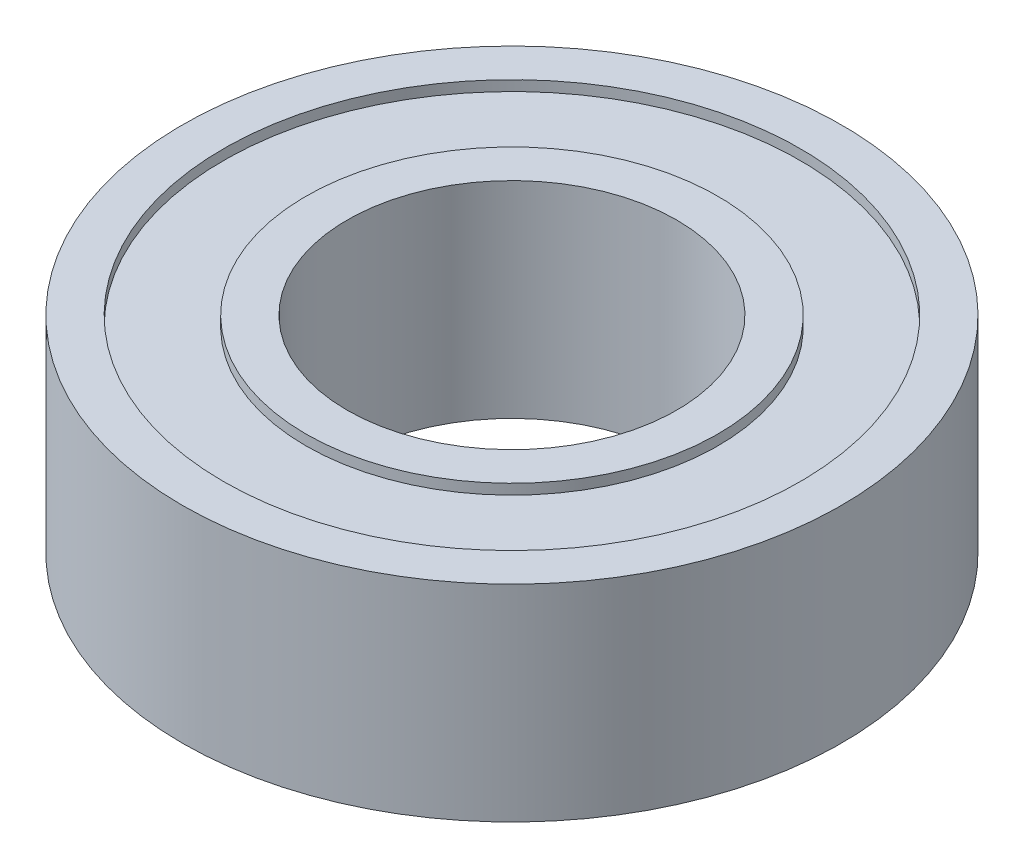
ISO-10303-21;
HEADER;
FILE_DESCRIPTION(('STEP AP214'),'2;1');
FILE_NAME('part.step','',(''),(''),'','','');
FILE_SCHEMA(('AUTOMOTIVE_DESIGN { 1 0 10303 214 1 1 1 1 }'));
ENDSEC;
DATA;
#1=APPLICATION_CONTEXT('core data for automotive mechanical design processes');
#2=APPLICATION_PROTOCOL_DEFINITION('international standard','automotive_design',2000,#1);
#3=PRODUCT_CONTEXT('',#1,'mechanical');
#4=PRODUCT('Part','Part','',(#3));
#5=PRODUCT_RELATED_PRODUCT_CATEGORY('part','',(#4));
#6=PRODUCT_DEFINITION_FORMATION('','',#4);
#7=PRODUCT_DEFINITION_CONTEXT('part definition',#1,'design');
#8=PRODUCT_DEFINITION('design','',#6,#7);
#9=PRODUCT_DEFINITION_SHAPE('','',#8);
#10=(LENGTH_UNIT() NAMED_UNIT(*) SI_UNIT(.MILLI.,.METRE.));
#11=(NAMED_UNIT(*) PLANE_ANGLE_UNIT() SI_UNIT($,.RADIAN.));
#12=(NAMED_UNIT(*) SI_UNIT($,.STERADIAN.) SOLID_ANGLE_UNIT());
#13=UNCERTAINTY_MEASURE_WITH_UNIT(LENGTH_MEASURE(1.E-05),#10,'distance_accuracy_value','');
#14=(GEOMETRIC_REPRESENTATION_CONTEXT(3) GLOBAL_UNCERTAINTY_ASSIGNED_CONTEXT((#13)) GLOBAL_UNIT_ASSIGNED_CONTEXT((#10,
#11,#12)) REPRESENTATION_CONTEXT('',''));
#15=CARTESIAN_POINT('',(0.,0.,0.));
#16=DIRECTION('',(0.,0.,1.));
#17=DIRECTION('',(1.,0.,0.));
#18=AXIS2_PLACEMENT_3D('',#15,#16,#17);
#19=CARTESIAN_POINT('',(0.,-2.25,0.));
#20=DIRECTION('',(0.,1.,0.));
#21=DIRECTION('',(0.,0.,1.));
#22=AXIS2_PLACEMENT_3D('',#19,#20,#21);
#23=CYLINDRICAL_SURFACE('',#22,7.);
#24=CARTESIAN_POINT('',(0.,-2.25,0.));
#25=DIRECTION('',(0.,1.,0.));
#26=DIRECTION('',(0.,0.,1.));
#27=AXIS2_PLACEMENT_3D('',#24,#25,#26);
#28=CIRCLE('',#27,7.);
#29=CARTESIAN_POINT('',(0.,-2.25,7.));
#30=VERTEX_POINT('',#29);
#31=EDGE_CURVE('E12',#30,#30,#28,.T.);
#32=ORIENTED_EDGE('',*,*,#31,.T.);
#33=EDGE_LOOP('',(#32));
#34=FACE_BOUND('',#33,.T.);
#35=CARTESIAN_POINT('',(0.,2.25,0.));
#36=DIRECTION('',(0.,1.,0.));
#37=DIRECTION('',(0.,0.,1.));
#38=AXIS2_PLACEMENT_3D('',#35,#36,#37);
#39=CIRCLE('',#38,7.);
#40=CARTESIAN_POINT('',(0.,2.25,7.));
#41=VERTEX_POINT('',#40);
#42=EDGE_CURVE('E61',#41,#41,#39,.T.);
#43=ORIENTED_EDGE('',*,*,#42,.F.);
#44=EDGE_LOOP('',(#43));
#45=FACE_BOUND('',#44,.T.);
#46=ADVANCED_FACE('F51',(#34,#45),#23,.T.);
#47=CARTESIAN_POINT('',(0.,-2.25,0.));
#48=DIRECTION('',(0.,1.,0.));
#49=DIRECTION('',(0.,0.,1.));
#50=AXIS2_PLACEMENT_3D('',#47,#48,#49);
#51=PLANE('',#50);
#52=CARTESIAN_POINT('',(0.,-2.25,0.));
#53=DIRECTION('',(0.,1.,0.));
#54=DIRECTION('',(0.,0.,1.));
#55=AXIS2_PLACEMENT_3D('',#52,#53,#54);
#56=CIRCLE('',#55,5.);
#57=CARTESIAN_POINT('',(0.,-2.25,5.));
#58=VERTEX_POINT('',#57);
#59=EDGE_CURVE('E57',#58,#58,#56,.T.);
#60=ORIENTED_EDGE('',*,*,#59,.T.);
#61=EDGE_LOOP('',(#60));
#62=FACE_BOUND('',#61,.T.);
#63=ORIENTED_EDGE('',*,*,#31,.F.);
#64=EDGE_LOOP('',(#63));
#65=FACE_BOUND('',#64,.T.);
#66=ADVANCED_FACE('F80',(#62,#65),#51,.F.);
#67=CARTESIAN_POINT('',(0.,-2.25,0.));
#68=DIRECTION('',(0.,1.,0.));
#69=DIRECTION('',(0.,0.,1.));
#70=AXIS2_PLACEMENT_3D('',#67,#68,#69);
#71=CYLINDRICAL_SURFACE('',#70,5.);
#72=ORIENTED_EDGE('',*,*,#59,.F.);
#73=EDGE_LOOP('',(#72));
#74=FACE_BOUND('',#73,.T.);
#75=CARTESIAN_POINT('',(0.,2.25,0.));
#76=DIRECTION('',(0.,1.,0.));
#77=DIRECTION('',(0.,0.,1.));
#78=AXIS2_PLACEMENT_3D('',#75,#76,#77);
#79=CIRCLE('',#78,5.);
#80=CARTESIAN_POINT('',(0.,2.25,5.));
#81=VERTEX_POINT('',#80);
#82=EDGE_CURVE('E65',#81,#81,#79,.T.);
#83=ORIENTED_EDGE('',*,*,#82,.T.);
#84=EDGE_LOOP('',(#83));
#85=FACE_BOUND('',#84,.T.);
#86=ADVANCED_FACE('F71',(#74,#85),#71,.F.);
#87=CARTESIAN_POINT('',(0.,2.25,0.));
#88=DIRECTION('',(0.,1.,0.));
#89=DIRECTION('',(0.,0.,1.));
#90=AXIS2_PLACEMENT_3D('',#87,#88,#89);
#91=PLANE('',#90);
#92=ORIENTED_EDGE('',*,*,#42,.T.);
#93=EDGE_LOOP('',(#92));
#94=FACE_BOUND('',#93,.T.);
#95=ORIENTED_EDGE('',*,*,#82,.F.);
#96=EDGE_LOOP('',(#95));
#97=FACE_BOUND('',#96,.T.);
#98=ADVANCED_FACE('F73',(#94,#97),#91,.T.);
#99=CLOSED_SHELL('',(#46,#66,#86,#98));
#100=MANIFOLD_SOLID_BREP('B2',#99);
#101=CARTESIAN_POINT('',(0.,-2.5,0.));
#102=DIRECTION('',(0.,1.,0.));
#103=DIRECTION('',(0.,0.,1.));
#104=AXIS2_PLACEMENT_3D('',#101,#102,#103);
#105=CYLINDRICAL_SURFACE('',#104,4.);
#106=CARTESIAN_POINT('',(0.,-2.5,0.));
#107=DIRECTION('',(0.,1.,0.));
#108=DIRECTION('',(0.,0.,1.));
#109=AXIS2_PLACEMENT_3D('',#106,#107,#108);
#110=CIRCLE('',#109,4.);
#111=CARTESIAN_POINT('',(0.,-2.5,4.));
#112=VERTEX_POINT('',#111);
#113=EDGE_CURVE('E125',#112,#112,#110,.T.);
#114=ORIENTED_EDGE('',*,*,#113,.F.);
#115=EDGE_LOOP('',(#114));
#116=FACE_BOUND('',#115,.T.);
#117=CARTESIAN_POINT('',(0.,2.5,0.));
#118=DIRECTION('',(0.,1.,0.));
#119=DIRECTION('',(0.,0.,1.));
#120=AXIS2_PLACEMENT_3D('',#117,#118,#119);
#121=CIRCLE('',#120,4.);
#122=CARTESIAN_POINT('',(0.,2.5,4.));
#123=VERTEX_POINT('',#122);
#124=EDGE_CURVE('E133',#123,#123,#121,.T.);
#125=ORIENTED_EDGE('',*,*,#124,.T.);
#126=EDGE_LOOP('',(#125));
#127=FACE_BOUND('',#126,.T.);
#128=ADVANCED_FACE('F119',(#116,#127),#105,.F.);
#129=CARTESIAN_POINT('',(0.,-2.5,0.));
#130=DIRECTION('',(0.,1.,0.));
#131=DIRECTION('',(0.,0.,1.));
#132=AXIS2_PLACEMENT_3D('',#129,#130,#131);
#133=CYLINDRICAL_SURFACE('',#132,5.);
#134=CARTESIAN_POINT('',(0.,-2.5,0.));
#135=DIRECTION('',(0.,1.,0.));
#136=DIRECTION('',(0.,0.,1.));
#137=AXIS2_PLACEMENT_3D('',#134,#135,#136);
#138=CIRCLE('',#137,5.);
#139=CARTESIAN_POINT('',(0.,-2.5,5.));
#140=VERTEX_POINT('',#139);
#141=EDGE_CURVE('E50',#140,#140,#138,.T.);
#142=ORIENTED_EDGE('',*,*,#141,.T.);
#143=EDGE_LOOP('',(#142));
#144=FACE_BOUND('',#143,.T.);
#145=CARTESIAN_POINT('',(0.,2.5,0.));
#146=DIRECTION('',(0.,1.,0.));
#147=DIRECTION('',(0.,0.,1.));
#148=AXIS2_PLACEMENT_3D('',#145,#146,#147);
#149=CIRCLE('',#148,5.);
#150=CARTESIAN_POINT('',(0.,2.5,5.));
#151=VERTEX_POINT('',#150);
#152=EDGE_CURVE('E129',#151,#151,#149,.T.);
#153=ORIENTED_EDGE('',*,*,#152,.F.);
#154=EDGE_LOOP('',(#153));
#155=FACE_BOUND('',#154,.T.);
#156=ADVANCED_FACE('F147',(#144,#155),#133,.T.);
#157=CARTESIAN_POINT('',(0.,-2.5,0.));
#158=DIRECTION('',(0.,1.,0.));
#159=DIRECTION('',(0.,0.,1.));
#160=AXIS2_PLACEMENT_3D('',#157,#158,#159);
#161=PLANE('',#160);
#162=ORIENTED_EDGE('',*,*,#113,.T.);
#163=EDGE_LOOP('',(#162));
#164=FACE_BOUND('',#163,.T.);
#165=ORIENTED_EDGE('',*,*,#141,.F.);
#166=EDGE_LOOP('',(#165));
#167=FACE_BOUND('',#166,.T.);
#168=ADVANCED_FACE('F143',(#164,#167),#161,.F.);
#169=CARTESIAN_POINT('',(0.,2.5,0.));
#170=DIRECTION('',(0.,1.,0.));
#171=DIRECTION('',(0.,0.,1.));
#172=AXIS2_PLACEMENT_3D('',#169,#170,#171);
#173=PLANE('',#172);
#174=ORIENTED_EDGE('',*,*,#124,.F.);
#175=EDGE_LOOP('',(#174));
#176=FACE_BOUND('',#175,.T.);
#177=ORIENTED_EDGE('',*,*,#152,.T.);
#178=EDGE_LOOP('',(#177));
#179=FACE_BOUND('',#178,.T.);
#180=ADVANCED_FACE('F140',(#176,#179),#173,.T.);
#181=CLOSED_SHELL('',(#128,#156,#168,#180));
#182=MANIFOLD_SOLID_BREP('B7',#181);
#183=CARTESIAN_POINT('',(0.,-2.5,0.));
#184=DIRECTION('',(0.,1.,0.));
#185=DIRECTION('',(0.,0.,1.));
#186=AXIS2_PLACEMENT_3D('',#183,#184,#185);
#187=CYLINDRICAL_SURFACE('',#186,7.);
#188=CARTESIAN_POINT('',(0.,-2.5,0.));
#189=DIRECTION('',(0.,1.,0.));
#190=DIRECTION('',(0.,0.,1.));
#191=AXIS2_PLACEMENT_3D('',#188,#189,#190);
#192=CIRCLE('',#191,7.);
#193=CARTESIAN_POINT('',(0.,-2.5,7.));
#194=VERTEX_POINT('',#193);
#195=EDGE_CURVE('E186',#194,#194,#192,.T.);
#196=ORIENTED_EDGE('',*,*,#195,.F.);
#197=EDGE_LOOP('',(#196));
#198=FACE_BOUND('',#197,.T.);
#199=CARTESIAN_POINT('',(0.,2.5,0.));
#200=DIRECTION('',(0.,1.,0.));
#201=DIRECTION('',(0.,0.,1.));
#202=AXIS2_PLACEMENT_3D('',#199,#200,#201);
#203=CIRCLE('',#202,7.);
#204=CARTESIAN_POINT('',(0.,2.5,7.));
#205=VERTEX_POINT('',#204);
#206=EDGE_CURVE('E194',#205,#205,#203,.T.);
#207=ORIENTED_EDGE('',*,*,#206,.T.);
#208=EDGE_LOOP('',(#207));
#209=FACE_BOUND('',#208,.T.);
#210=ADVANCED_FACE('F180',(#198,#209),#187,.F.);
#211=CARTESIAN_POINT('',(0.,-2.5,0.));
#212=DIRECTION('',(0.,1.,0.));
#213=DIRECTION('',(0.,0.,1.));
#214=AXIS2_PLACEMENT_3D('',#211,#212,#213);
#215=CYLINDRICAL_SURFACE('',#214,8.);
#216=CARTESIAN_POINT('',(0.,-2.5,0.));
#217=DIRECTION('',(0.,1.,0.));
#218=DIRECTION('',(0.,0.,1.));
#219=AXIS2_PLACEMENT_3D('',#216,#217,#218);
#220=CIRCLE('',#219,8.);
#221=CARTESIAN_POINT('',(0.,-2.5,8.));
#222=VERTEX_POINT('',#221);
#223=EDGE_CURVE('E118',#222,#222,#220,.T.);
#224=ORIENTED_EDGE('',*,*,#223,.T.);
#225=EDGE_LOOP('',(#224));
#226=FACE_BOUND('',#225,.T.);
#227=CARTESIAN_POINT('',(0.,2.5,0.));
#228=DIRECTION('',(0.,1.,0.));
#229=DIRECTION('',(0.,0.,1.));
#230=AXIS2_PLACEMENT_3D('',#227,#228,#229);
#231=CIRCLE('',#230,8.);
#232=CARTESIAN_POINT('',(0.,2.5,8.));
#233=VERTEX_POINT('',#232);
#234=EDGE_CURVE('E190',#233,#233,#231,.T.);
#235=ORIENTED_EDGE('',*,*,#234,.F.);
#236=EDGE_LOOP('',(#235));
#237=FACE_BOUND('',#236,.T.);
#238=ADVANCED_FACE('F208',(#226,#237),#215,.T.);
#239=CARTESIAN_POINT('',(0.,-2.5,0.));
#240=DIRECTION('',(0.,1.,0.));
#241=DIRECTION('',(0.,0.,1.));
#242=AXIS2_PLACEMENT_3D('',#239,#240,#241);
#243=PLANE('',#242);
#244=ORIENTED_EDGE('',*,*,#195,.T.);
#245=EDGE_LOOP('',(#244));
#246=FACE_BOUND('',#245,.T.);
#247=ORIENTED_EDGE('',*,*,#223,.F.);
#248=EDGE_LOOP('',(#247));
#249=FACE_BOUND('',#248,.T.);
#250=ADVANCED_FACE('F204',(#246,#249),#243,.F.);
#251=CARTESIAN_POINT('',(0.,2.5,0.));
#252=DIRECTION('',(0.,1.,0.));
#253=DIRECTION('',(0.,0.,1.));
#254=AXIS2_PLACEMENT_3D('',#251,#252,#253);
#255=PLANE('',#254);
#256=ORIENTED_EDGE('',*,*,#206,.F.);
#257=EDGE_LOOP('',(#256));
#258=FACE_BOUND('',#257,.T.);
#259=ORIENTED_EDGE('',*,*,#234,.T.);
#260=EDGE_LOOP('',(#259));
#261=FACE_BOUND('',#260,.T.);
#262=ADVANCED_FACE('F201',(#258,#261),#255,.T.);
#263=CLOSED_SHELL('',(#210,#238,#250,#262));
#264=MANIFOLD_SOLID_BREP('B45',#263);
#265=ADVANCED_BREP_SHAPE_REPRESENTATION('',(#18,#100,#182,#264),#14);
#266=SHAPE_DEFINITION_REPRESENTATION(#9,#265);
ENDSEC;
END-ISO-10303-21;
